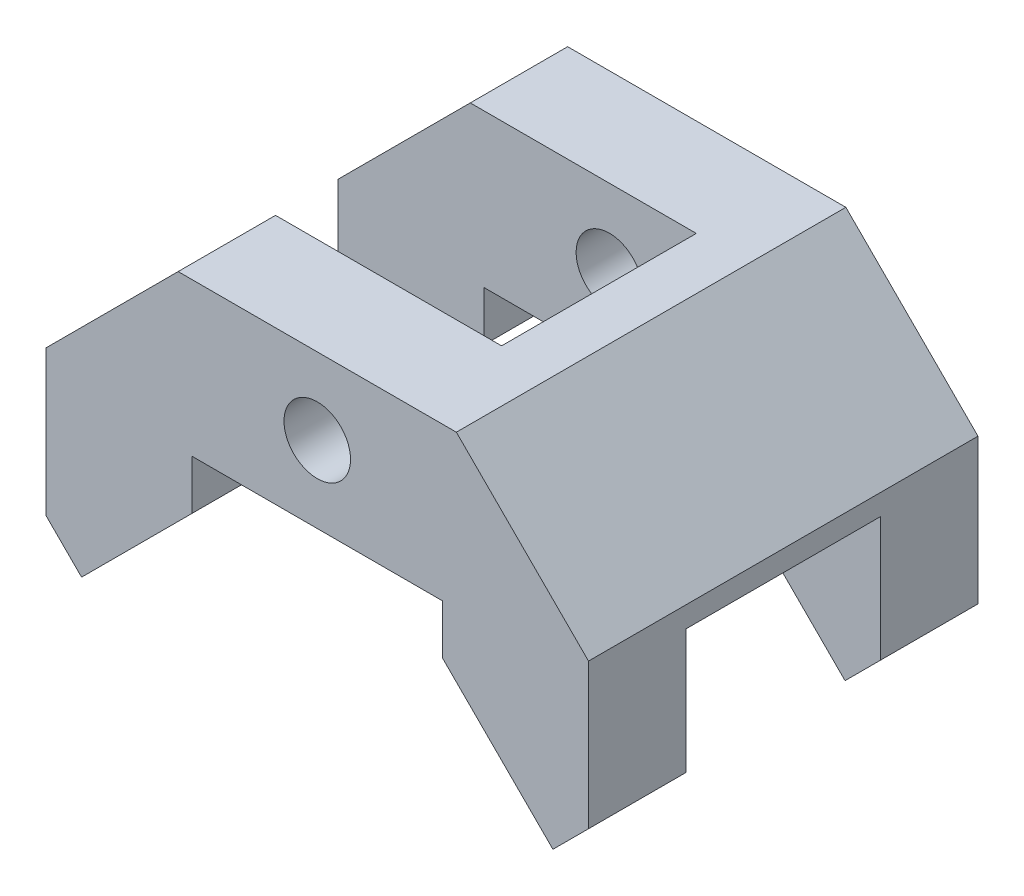
ISO-10303-21;
HEADER;
FILE_DESCRIPTION(('STEP AP214'),'2;1');
FILE_NAME('part.step','',(''),(''),'','','');
FILE_SCHEMA(('AUTOMOTIVE_DESIGN { 1 0 10303 214 1 1 1 1 }'));
ENDSEC;
DATA;
#1=APPLICATION_CONTEXT('core data for automotive mechanical design processes');
#2=APPLICATION_PROTOCOL_DEFINITION('international standard','automotive_design',2000,#1);
#3=PRODUCT_CONTEXT('',#1,'mechanical');
#4=PRODUCT('Part','Part','',(#3));
#5=PRODUCT_RELATED_PRODUCT_CATEGORY('part','',(#4));
#6=PRODUCT_DEFINITION_FORMATION('','',#4);
#7=PRODUCT_DEFINITION_CONTEXT('part definition',#1,'design');
#8=PRODUCT_DEFINITION('design','',#6,#7);
#9=PRODUCT_DEFINITION_SHAPE('','',#8);
#10=(LENGTH_UNIT() NAMED_UNIT(*) SI_UNIT(.MILLI.,.METRE.));
#11=(NAMED_UNIT(*) PLANE_ANGLE_UNIT() SI_UNIT($,.RADIAN.));
#12=(NAMED_UNIT(*) SI_UNIT($,.STERADIAN.) SOLID_ANGLE_UNIT());
#13=UNCERTAINTY_MEASURE_WITH_UNIT(LENGTH_MEASURE(1.E-05),#10,'distance_accuracy_value','');
#14=(GEOMETRIC_REPRESENTATION_CONTEXT(3) GLOBAL_UNCERTAINTY_ASSIGNED_CONTEXT((#13)) GLOBAL_UNIT_ASSIGNED_CONTEXT((#10,
#11,#12)) REPRESENTATION_CONTEXT('',''));
#15=CARTESIAN_POINT('',(0.,0.,0.));
#16=DIRECTION('',(0.,0.,1.));
#17=DIRECTION('',(1.,0.,0.));
#18=AXIS2_PLACEMENT_3D('',#15,#16,#17);
#19=CARTESIAN_POINT('',(18.,-22.,28.));
#20=DIRECTION('',(1.,0.,0.));
#21=DIRECTION('',(0.,0.,-1.));
#22=AXIS2_PLACEMENT_3D('',#19,#20,#21);
#23=PLANE('',#22);
#24=DIRECTION('',(0.,0.,-1.));
#25=VECTOR('',#24,1.);
#26=CARTESIAN_POINT('',(18.,-29.1126983722081,28.));
#27=LINE('',#26,#25);
#28=CARTESIAN_POINT('',(18.,-29.1126983722081,-14.));
#29=VERTEX_POINT('',#28);
#30=CARTESIAN_POINT('',(18.,-29.1126983722081,-28.));
#31=VERTEX_POINT('',#30);
#32=EDGE_CURVE('E360',#29,#31,#27,.T.);
#33=ORIENTED_EDGE('',*,*,#32,.F.);
#34=DIRECTION('',(0.,1.,0.));
#35=VECTOR('',#34,1.);
#36=CARTESIAN_POINT('',(18.,-22.,-14.));
#37=LINE('',#36,#35);
#38=CARTESIAN_POINT('',(18.,-22.,-14.));
#39=VERTEX_POINT('',#38);
#40=EDGE_CURVE('E235',#29,#39,#37,.T.);
#41=ORIENTED_EDGE('',*,*,#40,.T.);
#42=DIRECTION('',(0.,0.,-1.));
#43=VECTOR('',#42,1.);
#44=CARTESIAN_POINT('',(18.,-22.,28.));
#45=LINE('',#44,#43);
#46=CARTESIAN_POINT('',(18.,-22.,-28.));
#47=VERTEX_POINT('',#46);
#48=EDGE_CURVE('E204',#39,#47,#45,.T.);
#49=ORIENTED_EDGE('',*,*,#48,.T.);
#50=DIRECTION('',(0.,-1.,0.));
#51=VECTOR('',#50,1.);
#52=CARTESIAN_POINT('',(18.,-22.,-28.));
#53=LINE('',#52,#51);
#54=EDGE_CURVE('E335',#47,#31,#53,.T.);
#55=ORIENTED_EDGE('',*,*,#54,.T.);
#56=EDGE_LOOP('',(#33,#41,#49,#55));
#57=FACE_BOUND('',#56,.T.);
#58=ADVANCED_FACE('F33',(#57),#23,.F.);
#59=CARTESIAN_POINT('',(18.,-29.1126983722081,28.));
#60=DIRECTION('',(0.707106781186548,0.707106781186547,0.));
#61=DIRECTION('',(-0.707106781186547,0.707106781186548,0.));
#62=AXIS2_PLACEMENT_3D('',#59,#60,#61);
#63=PLANE('',#62);
#64=DIRECTION('',(0.,0.,-1.));
#65=VECTOR('',#64,1.);
#66=CARTESIAN_POINT('',(33.8847763108502,-44.9974746830584,28.));
#67=LINE('',#66,#65);
#68=CARTESIAN_POINT('',(33.8847763108502,-44.9974746830584,-14.));
#69=VERTEX_POINT('',#68);
#70=CARTESIAN_POINT('',(33.8847763108502,-44.9974746830584,-28.));
#71=VERTEX_POINT('',#70);
#72=EDGE_CURVE('E356',#69,#71,#67,.T.);
#73=ORIENTED_EDGE('',*,*,#72,.F.);
#74=DIRECTION('',(-0.707106781186547,0.707106781186548,0.));
#75=VECTOR('',#74,1.);
#76=CARTESIAN_POINT('',(18.,-29.1126983722081,-14.));
#77=LINE('',#76,#75);
#78=EDGE_CURVE('E232',#69,#29,#77,.T.);
#79=ORIENTED_EDGE('',*,*,#78,.T.);
#80=ORIENTED_EDGE('',*,*,#32,.T.);
#81=DIRECTION('',(0.707106781186547,-0.707106781186548,0.));
#82=VECTOR('',#81,1.);
#83=CARTESIAN_POINT('',(18.,-29.1126983722081,-28.));
#84=LINE('',#83,#82);
#85=EDGE_CURVE('E338',#31,#71,#84,.T.);
#86=ORIENTED_EDGE('',*,*,#85,.T.);
#87=EDGE_LOOP('',(#73,#79,#80,#86));
#88=FACE_BOUND('',#87,.T.);
#89=ADVANCED_FACE('F423',(#88),#63,.F.);
#90=CARTESIAN_POINT('',(33.8847763108502,-44.9974746830584,28.));
#91=DIRECTION('',(-0.707106781186547,0.707106781186548,0.));
#92=DIRECTION('',(-0.707106781186548,-0.707106781186547,0.));
#93=AXIS2_PLACEMENT_3D('',#90,#91,#92);
#94=PLANE('',#93);
#95=DIRECTION('',(0.,0.,-1.));
#96=VECTOR('',#95,1.);
#97=CARTESIAN_POINT('',(39.,-39.8822509939086,28.));
#98=LINE('',#97,#96);
#99=CARTESIAN_POINT('',(39.,-39.8822509939086,-14.));
#100=VERTEX_POINT('',#99);
#101=CARTESIAN_POINT('',(39.,-39.8822509939086,-28.));
#102=VERTEX_POINT('',#101);
#103=EDGE_CURVE('E353',#100,#102,#98,.T.);
#104=ORIENTED_EDGE('',*,*,#103,.F.);
#105=DIRECTION('',(-0.707106781186548,-0.707106781186547,0.));
#106=VECTOR('',#105,1.);
#107=CARTESIAN_POINT('',(33.8847763108502,-44.9974746830584,-14.));
#108=LINE('',#107,#106);
#109=EDGE_CURVE('E214',#100,#69,#108,.T.);
#110=ORIENTED_EDGE('',*,*,#109,.T.);
#111=ORIENTED_EDGE('',*,*,#72,.T.);
#112=DIRECTION('',(0.707106781186548,0.707106781186547,0.));
#113=VECTOR('',#112,1.);
#114=CARTESIAN_POINT('',(33.8847763108502,-44.9974746830584,-28.));
#115=LINE('',#114,#113);
#116=EDGE_CURVE('E341',#71,#102,#115,.T.);
#117=ORIENTED_EDGE('',*,*,#116,.T.);
#118=EDGE_LOOP('',(#104,#110,#111,#117));
#119=FACE_BOUND('',#118,.T.);
#120=ADVANCED_FACE('F425',(#119),#94,.F.);
#121=CARTESIAN_POINT('',(-20.,0.,28.));
#122=DIRECTION('',(0.707106781186549,-0.707106781186546,0.));
#123=DIRECTION('',(0.707106781186546,0.707106781186549,0.));
#124=AXIS2_PLACEMENT_3D('',#121,#122,#123);
#125=PLANE('',#124);
#126=DIRECTION('',(0.,0.,-1.));
#127=VECTOR('',#126,1.);
#128=CARTESIAN_POINT('',(-39.,-19.0000000000001,28.));
#129=LINE('',#128,#127);
#130=CARTESIAN_POINT('',(-39.,-19.0000000000001,-14.));
#131=VERTEX_POINT('',#130);
#132=CARTESIAN_POINT('',(-39.,-19.0000000000001,-28.));
#133=VERTEX_POINT('',#132);
#134=EDGE_CURVE('E383',#131,#133,#129,.T.);
#135=ORIENTED_EDGE('',*,*,#134,.F.);
#136=DIRECTION('',(0.707106781186546,0.707106781186549,0.));
#137=VECTOR('',#136,1.);
#138=CARTESIAN_POINT('',(-20.,0.,-14.));
#139=LINE('',#138,#137);
#140=CARTESIAN_POINT('',(-20.,0.,-14.));
#141=VERTEX_POINT('',#140);
#142=EDGE_CURVE('E280',#131,#141,#139,.T.);
#143=ORIENTED_EDGE('',*,*,#142,.T.);
#144=DIRECTION('',(0.,0.,-1.));
#145=VECTOR('',#144,1.);
#146=CARTESIAN_POINT('',(-20.,0.,28.));
#147=LINE('',#146,#145);
#148=CARTESIAN_POINT('',(-20.,0.,-28.));
#149=VERTEX_POINT('',#148);
#150=EDGE_CURVE('E387',#141,#149,#147,.T.);
#151=ORIENTED_EDGE('',*,*,#150,.T.);
#152=DIRECTION('',(-0.707106781186546,-0.707106781186549,0.));
#153=VECTOR('',#152,1.);
#154=CARTESIAN_POINT('',(-20.,0.,-28.));
#155=LINE('',#154,#153);
#156=EDGE_CURVE('E318',#149,#133,#155,.T.);
#157=ORIENTED_EDGE('',*,*,#156,.T.);
#158=EDGE_LOOP('',(#135,#143,#151,#157));
#159=FACE_BOUND('',#158,.T.);
#160=ADVANCED_FACE('F483',(#159),#125,.F.);
#161=CARTESIAN_POINT('',(-39.,-19.0000000000001,28.));
#162=DIRECTION('',(1.,0.,0.));
#163=DIRECTION('',(0.,0.,-1.));
#164=AXIS2_PLACEMENT_3D('',#161,#162,#163);
#165=PLANE('',#164);
#166=DIRECTION('',(0.,0.,-1.));
#167=VECTOR('',#166,1.);
#168=CARTESIAN_POINT('',(-39.,-39.8822509939086,28.));
#169=LINE('',#168,#167);
#170=CARTESIAN_POINT('',(-39.,-39.8822509939086,-14.));
#171=VERTEX_POINT('',#170);
#172=CARTESIAN_POINT('',(-39.,-39.8822509939086,-28.));
#173=VERTEX_POINT('',#172);
#174=EDGE_CURVE('E379',#171,#173,#169,.T.);
#175=ORIENTED_EDGE('',*,*,#174,.F.);
#176=DIRECTION('',(0.,1.,0.));
#177=VECTOR('',#176,1.);
#178=CARTESIAN_POINT('',(-39.,-44.9974746830584,-14.));
#179=LINE('',#178,#177);
#180=EDGE_CURVE('E245',#171,#131,#179,.T.);
#181=ORIENTED_EDGE('',*,*,#180,.T.);
#182=ORIENTED_EDGE('',*,*,#134,.T.);
#183=DIRECTION('',(0.,-1.,0.));
#184=VECTOR('',#183,1.);
#185=CARTESIAN_POINT('',(-39.,-19.0000000000001,-28.));
#186=LINE('',#185,#184);
#187=EDGE_CURVE('E321',#133,#173,#186,.T.);
#188=ORIENTED_EDGE('',*,*,#187,.T.);
#189=EDGE_LOOP('',(#175,#181,#182,#188));
#190=FACE_BOUND('',#189,.T.);
#191=ADVANCED_FACE('F489',(#190),#165,.F.);
#192=CARTESIAN_POINT('',(-39.,-39.8822509939086,28.));
#193=DIRECTION('',(0.707106781186546,0.707106781186549,0.));
#194=DIRECTION('',(-0.707106781186549,0.707106781186546,0.));
#195=AXIS2_PLACEMENT_3D('',#192,#193,#194);
#196=PLANE('',#195);
#197=DIRECTION('',(0.,0.,-1.));
#198=VECTOR('',#197,1.);
#199=CARTESIAN_POINT('',(-33.8847763108502,-44.9974746830584,28.));
#200=LINE('',#199,#198);
#201=CARTESIAN_POINT('',(-33.8847763108502,-44.9974746830584,-14.));
#202=VERTEX_POINT('',#201);
#203=CARTESIAN_POINT('',(-33.8847763108502,-44.9974746830584,-28.));
#204=VERTEX_POINT('',#203);
#205=EDGE_CURVE('E375',#202,#204,#200,.T.);
#206=ORIENTED_EDGE('',*,*,#205,.F.);
#207=DIRECTION('',(-0.707106781186549,0.707106781186546,0.));
#208=VECTOR('',#207,1.);
#209=CARTESIAN_POINT('',(-39.,-39.8822509939086,-14.));
#210=LINE('',#209,#208);
#211=EDGE_CURVE('E277',#202,#171,#210,.T.);
#212=ORIENTED_EDGE('',*,*,#211,.T.);
#213=ORIENTED_EDGE('',*,*,#174,.T.);
#214=DIRECTION('',(0.707106781186549,-0.707106781186546,0.));
#215=VECTOR('',#214,1.);
#216=CARTESIAN_POINT('',(-39.,-39.8822509939086,-28.));
#217=LINE('',#216,#215);
#218=EDGE_CURVE('E324',#173,#204,#217,.T.);
#219=ORIENTED_EDGE('',*,*,#218,.T.);
#220=EDGE_LOOP('',(#206,#212,#213,#219));
#221=FACE_BOUND('',#220,.T.);
#222=ADVANCED_FACE('F512',(#221),#196,.F.);
#223=CARTESIAN_POINT('',(-33.8847763108502,-44.9974746830584,28.));
#224=DIRECTION('',(-0.707106781186549,0.707106781186546,0.));
#225=DIRECTION('',(-0.707106781186546,-0.707106781186549,0.));
#226=AXIS2_PLACEMENT_3D('',#223,#224,#225);
#227=PLANE('',#226);
#228=DIRECTION('',(0.,0.,-1.));
#229=VECTOR('',#228,1.);
#230=CARTESIAN_POINT('',(-18.,-29.1126983722081,28.));
#231=LINE('',#230,#229);
#232=CARTESIAN_POINT('',(-18.,-29.1126983722081,-14.));
#233=VERTEX_POINT('',#232);
#234=CARTESIAN_POINT('',(-18.,-29.1126983722081,-28.));
#235=VERTEX_POINT('',#234);
#236=EDGE_CURVE('E371',#233,#235,#231,.T.);
#237=ORIENTED_EDGE('',*,*,#236,.F.);
#238=DIRECTION('',(-0.707106781186546,-0.707106781186549,0.));
#239=VECTOR('',#238,1.);
#240=CARTESIAN_POINT('',(-33.8847763108502,-44.9974746830584,-14.));
#241=LINE('',#240,#239);
#242=EDGE_CURVE('E274',#233,#202,#241,.T.);
#243=ORIENTED_EDGE('',*,*,#242,.T.);
#244=ORIENTED_EDGE('',*,*,#205,.T.);
#245=DIRECTION('',(0.707106781186546,0.707106781186549,0.));
#246=VECTOR('',#245,1.);
#247=CARTESIAN_POINT('',(-33.8847763108502,-44.9974746830584,-28.));
#248=LINE('',#247,#246);
#249=EDGE_CURVE('E327',#204,#235,#248,.T.);
#250=ORIENTED_EDGE('',*,*,#249,.T.);
#251=EDGE_LOOP('',(#237,#243,#244,#250));
#252=FACE_BOUND('',#251,.T.);
#253=ADVANCED_FACE('F407',(#252),#227,.F.);
#254=CARTESIAN_POINT('',(-18.,-29.1126983722081,28.));
#255=DIRECTION('',(-1.,0.,0.));
#256=DIRECTION('',(0.,-1.,0.));
#257=AXIS2_PLACEMENT_3D('',#254,#255,#256);
#258=PLANE('',#257);
#259=DIRECTION('',(0.,0.,-1.));
#260=VECTOR('',#259,1.);
#261=CARTESIAN_POINT('',(-18.,-22.,28.));
#262=LINE('',#261,#260);
#263=CARTESIAN_POINT('',(-18.,-22.,-14.));
#264=VERTEX_POINT('',#263);
#265=CARTESIAN_POINT('',(-18.,-22.,-28.));
#266=VERTEX_POINT('',#265);
#267=EDGE_CURVE('E367',#264,#266,#262,.T.);
#268=ORIENTED_EDGE('',*,*,#267,.F.);
#269=DIRECTION('',(0.,-1.,0.));
#270=VECTOR('',#269,1.);
#271=CARTESIAN_POINT('',(-18.,-29.1126983722081,-14.));
#272=LINE('',#271,#270);
#273=EDGE_CURVE('E271',#264,#233,#272,.T.);
#274=ORIENTED_EDGE('',*,*,#273,.T.);
#275=ORIENTED_EDGE('',*,*,#236,.T.);
#276=DIRECTION('',(0.,1.,0.));
#277=VECTOR('',#276,1.);
#278=CARTESIAN_POINT('',(-18.,-29.1126983722081,-28.));
#279=LINE('',#278,#277);
#280=EDGE_CURVE('E330',#235,#266,#279,.T.);
#281=ORIENTED_EDGE('',*,*,#280,.T.);
#282=EDGE_LOOP('',(#268,#274,#275,#281));
#283=FACE_BOUND('',#282,.T.);
#284=ADVANCED_FACE('F405',(#283),#258,.F.);
#285=CARTESIAN_POINT('',(0.,-11.,28.));
#286=DIRECTION('',(0.,0.,-1.));
#287=DIRECTION('',(-1.,0.,0.));
#288=AXIS2_PLACEMENT_3D('',#285,#286,#287);
#289=CYLINDRICAL_SURFACE('',#288,4.78154306918594);
#290=CARTESIAN_POINT('',(0.,-11.,-14.));
#291=DIRECTION('',(0.,0.,-1.));
#292=DIRECTION('',(-1.,0.,0.));
#293=AXIS2_PLACEMENT_3D('',#290,#291,#292);
#294=CIRCLE('',#293,4.78154306918594);
#295=CARTESIAN_POINT('',(-4.78154306918593,-11.,-14.));
#296=VERTEX_POINT('',#295);
#297=EDGE_CURVE('E267',#296,#296,#294,.T.);
#298=ORIENTED_EDGE('',*,*,#297,.F.);
#299=EDGE_LOOP('',(#298));
#300=FACE_BOUND('',#299,.T.);
#301=CARTESIAN_POINT('',(0.,-11.,-28.));
#302=DIRECTION('',(0.,0.,1.));
#303=DIRECTION('',(1.,0.,0.));
#304=AXIS2_PLACEMENT_3D('',#301,#302,#303);
#305=CIRCLE('',#304,4.78154306918594);
#306=CARTESIAN_POINT('',(4.78154306918594,-11.,-28.));
#307=VERTEX_POINT('',#306);
#308=EDGE_CURVE('E283',#307,#307,#305,.T.);
#309=ORIENTED_EDGE('',*,*,#308,.F.);
#310=EDGE_LOOP('',(#309));
#311=FACE_BOUND('',#310,.T.);
#312=ADVANCED_FACE('F585',(#300,#311),#289,.F.);
#313=CARTESIAN_POINT('',(0.,0.,28.));
#314=DIRECTION('',(0.,0.,1.));
#315=DIRECTION('',(1.,0.,0.));
#316=AXIS2_PLACEMENT_3D('',#313,#314,#315);
#317=PLANE('',#316);
#318=DIRECTION('',(-1.,0.,0.));
#319=VECTOR('',#318,1.);
#320=CARTESIAN_POINT('',(20.,0.,28.));
#321=LINE('',#320,#319);
#322=CARTESIAN_POINT('',(20.,0.,28.));
#323=VERTEX_POINT('',#322);
#324=CARTESIAN_POINT('',(-20.,0.,28.));
#325=VERTEX_POINT('',#324);
#326=EDGE_CURVE('E290',#323,#325,#321,.T.);
#327=ORIENTED_EDGE('',*,*,#326,.T.);
#328=DIRECTION('',(-0.707106781186546,-0.707106781186549,0.));
#329=VECTOR('',#328,1.);
#330=CARTESIAN_POINT('',(-20.,0.,28.));
#331=LINE('',#330,#329);
#332=CARTESIAN_POINT('',(-39.,-19.0000000000001,28.));
#333=VERTEX_POINT('',#332);
#334=EDGE_CURVE('E292',#325,#333,#331,.T.);
#335=ORIENTED_EDGE('',*,*,#334,.T.);
#336=DIRECTION('',(0.,-1.,0.));
#337=VECTOR('',#336,1.);
#338=CARTESIAN_POINT('',(-39.,-19.0000000000001,28.));
#339=LINE('',#338,#337);
#340=CARTESIAN_POINT('',(-39.,-39.8822509939086,28.));
#341=VERTEX_POINT('',#340);
#342=EDGE_CURVE('E295',#333,#341,#339,.T.);
#343=ORIENTED_EDGE('',*,*,#342,.T.);
#344=DIRECTION('',(0.707106781186549,-0.707106781186546,0.));
#345=VECTOR('',#344,1.);
#346=CARTESIAN_POINT('',(-39.,-39.8822509939086,28.));
#347=LINE('',#346,#345);
#348=CARTESIAN_POINT('',(-33.8847763108502,-44.9974746830584,28.));
#349=VERTEX_POINT('',#348);
#350=EDGE_CURVE('E297',#341,#349,#347,.T.);
#351=ORIENTED_EDGE('',*,*,#350,.T.);
#352=DIRECTION('',(0.707106781186546,0.707106781186549,0.));
#353=VECTOR('',#352,1.);
#354=CARTESIAN_POINT('',(-33.8847763108502,-44.9974746830584,28.));
#355=LINE('',#354,#353);
#356=CARTESIAN_POINT('',(-18.,-29.1126983722081,28.));
#357=VERTEX_POINT('',#356);
#358=EDGE_CURVE('E299',#349,#357,#355,.T.);
#359=ORIENTED_EDGE('',*,*,#358,.T.);
#360=DIRECTION('',(0.,1.,0.));
#361=VECTOR('',#360,1.);
#362=CARTESIAN_POINT('',(-18.,-29.1126983722081,28.));
#363=LINE('',#362,#361);
#364=CARTESIAN_POINT('',(-18.,-22.,28.));
#365=VERTEX_POINT('',#364);
#366=EDGE_CURVE('E301',#357,#365,#363,.T.);
#367=ORIENTED_EDGE('',*,*,#366,.T.);
#368=DIRECTION('',(1.,0.,0.));
#369=VECTOR('',#368,1.);
#370=CARTESIAN_POINT('',(-18.,-22.,28.));
#371=LINE('',#370,#369);
#372=CARTESIAN_POINT('',(18.,-22.,28.));
#373=VERTEX_POINT('',#372);
#374=EDGE_CURVE('E303',#365,#373,#371,.T.);
#375=ORIENTED_EDGE('',*,*,#374,.T.);
#376=DIRECTION('',(0.,-1.,0.));
#377=VECTOR('',#376,1.);
#378=CARTESIAN_POINT('',(18.,-22.,28.));
#379=LINE('',#378,#377);
#380=CARTESIAN_POINT('',(18.,-29.1126983722081,28.));
#381=VERTEX_POINT('',#380);
#382=EDGE_CURVE('E305',#373,#381,#379,.T.);
#383=ORIENTED_EDGE('',*,*,#382,.T.);
#384=DIRECTION('',(0.707106781186547,-0.707106781186548,0.));
#385=VECTOR('',#384,1.);
#386=CARTESIAN_POINT('',(18.,-29.1126983722081,28.));
#387=LINE('',#386,#385);
#388=CARTESIAN_POINT('',(33.8847763108502,-44.9974746830584,28.));
#389=VERTEX_POINT('',#388);
#390=EDGE_CURVE('E307',#381,#389,#387,.T.);
#391=ORIENTED_EDGE('',*,*,#390,.T.);
#392=DIRECTION('',(0.707106781186548,0.707106781186547,0.));
#393=VECTOR('',#392,1.);
#394=CARTESIAN_POINT('',(33.8847763108502,-44.9974746830584,28.));
#395=LINE('',#394,#393);
#396=CARTESIAN_POINT('',(39.,-39.8822509939086,28.));
#397=VERTEX_POINT('',#396);
#398=EDGE_CURVE('E309',#389,#397,#395,.T.);
#399=ORIENTED_EDGE('',*,*,#398,.T.);
#400=DIRECTION('',(0.,1.,0.));
#401=VECTOR('',#400,1.);
#402=CARTESIAN_POINT('',(39.,-39.8822509939086,28.));
#403=LINE('',#402,#401);
#404=CARTESIAN_POINT('',(39.,-19.0000000000001,28.));
#405=VERTEX_POINT('',#404);
#406=EDGE_CURVE('E311',#397,#405,#403,.T.);
#407=ORIENTED_EDGE('',*,*,#406,.T.);
#408=DIRECTION('',(-0.707106781186547,0.707106781186548,0.));
#409=VECTOR('',#408,1.);
#410=CARTESIAN_POINT('',(39.,-19.0000000000001,28.));
#411=LINE('',#410,#409);
#412=EDGE_CURVE('E313',#405,#323,#411,.T.);
#413=ORIENTED_EDGE('',*,*,#412,.T.);
#414=EDGE_LOOP('',(#327,#335,#343,#351,#359,#367,#375,#383,#391,#399,#407,#413));
#415=FACE_BOUND('',#414,.T.);
#416=CARTESIAN_POINT('',(0.,-11.,28.));
#417=DIRECTION('',(0.,0.,1.));
#418=DIRECTION('',(1.,0.,0.));
#419=AXIS2_PLACEMENT_3D('',#416,#417,#418);
#420=CIRCLE('',#419,4.78154306918594);
#421=CARTESIAN_POINT('',(4.78154306918594,-11.,28.));
#422=VERTEX_POINT('',#421);
#423=EDGE_CURVE('E284',#422,#422,#420,.T.);
#424=ORIENTED_EDGE('',*,*,#423,.F.);
#425=EDGE_LOOP('',(#424));
#426=FACE_BOUND('',#425,.T.);
#427=ADVANCED_FACE('F443',(#415,#426),#317,.T.);
#428=CARTESIAN_POINT('',(0.,0.,-28.));
#429=DIRECTION('',(0.,0.,1.));
#430=DIRECTION('',(1.,0.,0.));
#431=AXIS2_PLACEMENT_3D('',#428,#429,#430);
#432=PLANE('',#431);
#433=DIRECTION('',(-1.,0.,0.));
#434=VECTOR('',#433,1.);
#435=CARTESIAN_POINT('',(0.,0.,-28.));
#436=LINE('',#435,#434);
#437=CARTESIAN_POINT('',(20.,0.,-28.));
#438=VERTEX_POINT('',#437);
#439=EDGE_CURVE('E287',#438,#149,#436,.T.);
#440=ORIENTED_EDGE('',*,*,#439,.F.);
#441=DIRECTION('',(-0.707106781186547,0.707106781186548,0.));
#442=VECTOR('',#441,1.);
#443=CARTESIAN_POINT('',(39.,-19.0000000000001,-28.));
#444=LINE('',#443,#442);
#445=CARTESIAN_POINT('',(39.,-19.0000000000001,-28.));
#446=VERTEX_POINT('',#445);
#447=EDGE_CURVE('E293',#446,#438,#444,.T.);
#448=ORIENTED_EDGE('',*,*,#447,.F.);
#449=DIRECTION('',(0.,1.,0.));
#450=VECTOR('',#449,1.);
#451=CARTESIAN_POINT('',(39.,-39.8822509939086,-28.));
#452=LINE('',#451,#450);
#453=EDGE_CURVE('E344',#102,#446,#452,.T.);
#454=ORIENTED_EDGE('',*,*,#453,.F.);
#455=ORIENTED_EDGE('',*,*,#116,.F.);
#456=ORIENTED_EDGE('',*,*,#85,.F.);
#457=ORIENTED_EDGE('',*,*,#54,.F.);
#458=DIRECTION('',(1.,0.,0.));
#459=VECTOR('',#458,1.);
#460=CARTESIAN_POINT('',(-18.,-22.,-28.));
#461=LINE('',#460,#459);
#462=EDGE_CURVE('E333',#266,#47,#461,.T.);
#463=ORIENTED_EDGE('',*,*,#462,.F.);
#464=ORIENTED_EDGE('',*,*,#280,.F.);
#465=ORIENTED_EDGE('',*,*,#249,.F.);
#466=ORIENTED_EDGE('',*,*,#218,.F.);
#467=ORIENTED_EDGE('',*,*,#187,.F.);
#468=ORIENTED_EDGE('',*,*,#156,.F.);
#469=EDGE_LOOP('',(#440,#448,#454,#455,#456,#457,#463,#464,#465,#466,#467,#468));
#470=FACE_BOUND('',#469,.T.);
#471=ORIENTED_EDGE('',*,*,#308,.T.);
#472=EDGE_LOOP('',(#471));
#473=FACE_BOUND('',#472,.T.);
#474=ADVANCED_FACE('F414',(#470,#473),#432,.F.);
#475=CARTESIAN_POINT('',(0.,0.,28.));
#476=DIRECTION('',(0.,-1.,0.));
#477=DIRECTION('',(1.,0.,0.));
#478=AXIS2_PLACEMENT_3D('',#475,#476,#477);
#479=PLANE('',#478);
#480=ORIENTED_EDGE('',*,*,#150,.F.);
#481=DIRECTION('',(-1.,0.,0.));
#482=VECTOR('',#481,1.);
#483=CARTESIAN_POINT('',(-39.,0.,-14.));
#484=LINE('',#483,#482);
#485=CARTESIAN_POINT('',(12.5,0.,-14.));
#486=VERTEX_POINT('',#485);
#487=EDGE_CURVE('E242',#486,#141,#484,.T.);
#488=ORIENTED_EDGE('',*,*,#487,.F.);
#489=DIRECTION('',(0.,0.,-1.));
#490=VECTOR('',#489,1.);
#491=CARTESIAN_POINT('',(12.5,0.,-14.));
#492=LINE('',#491,#490);
#493=CARTESIAN_POINT('',(12.5,0.,14.));
#494=VERTEX_POINT('',#493);
#495=EDGE_CURVE('E239',#494,#486,#492,.T.);
#496=ORIENTED_EDGE('',*,*,#495,.F.);
#497=DIRECTION('',(1.,0.,0.));
#498=VECTOR('',#497,1.);
#499=CARTESIAN_POINT('',(-39.,0.,14.));
#500=LINE('',#499,#498);
#501=CARTESIAN_POINT('',(-20.,0.,14.));
#502=VERTEX_POINT('',#501);
#503=EDGE_CURVE('E237',#502,#494,#500,.T.);
#504=ORIENTED_EDGE('',*,*,#503,.F.);
#505=EDGE_CURVE('E388',#325,#502,#147,.T.);
#506=ORIENTED_EDGE('',*,*,#505,.F.);
#507=ORIENTED_EDGE('',*,*,#326,.F.);
#508=DIRECTION('',(0.,0.,-1.));
#509=VECTOR('',#508,1.);
#510=CARTESIAN_POINT('',(20.,0.,28.));
#511=LINE('',#510,#509);
#512=EDGE_CURVE('E315',#323,#438,#511,.T.);
#513=ORIENTED_EDGE('',*,*,#512,.T.);
#514=ORIENTED_EDGE('',*,*,#439,.T.);
#515=EDGE_LOOP('',(#480,#488,#496,#504,#506,#507,#513,#514));
#516=FACE_BOUND('',#515,.T.);
#517=ADVANCED_FACE('F35',(#516),#479,.F.);
#518=ORIENTED_EDGE('',*,*,#505,.T.);
#519=DIRECTION('',(-0.707106781186546,-0.707106781186549,0.));
#520=VECTOR('',#519,1.);
#521=CARTESIAN_POINT('',(-20.,0.,14.));
#522=LINE('',#521,#520);
#523=CARTESIAN_POINT('',(-39.,-19.0000000000001,14.));
#524=VERTEX_POINT('',#523);
#525=EDGE_CURVE('E264',#502,#524,#522,.T.);
#526=ORIENTED_EDGE('',*,*,#525,.T.);
#527=EDGE_CURVE('E384',#333,#524,#129,.T.);
#528=ORIENTED_EDGE('',*,*,#527,.F.);
#529=ORIENTED_EDGE('',*,*,#334,.F.);
#530=EDGE_LOOP('',(#518,#526,#528,#529));
#531=FACE_BOUND('',#530,.T.);
#532=ADVANCED_FACE('F481',(#531),#125,.F.);
#533=ORIENTED_EDGE('',*,*,#527,.T.);
#534=DIRECTION('',(0.,1.,0.));
#535=VECTOR('',#534,1.);
#536=CARTESIAN_POINT('',(-39.,-44.9974746830584,14.));
#537=LINE('',#536,#535);
#538=CARTESIAN_POINT('',(-39.,-39.8822509939086,14.));
#539=VERTEX_POINT('',#538);
#540=EDGE_CURVE('E244',#539,#524,#537,.T.);
#541=ORIENTED_EDGE('',*,*,#540,.F.);
#542=EDGE_CURVE('E380',#341,#539,#169,.T.);
#543=ORIENTED_EDGE('',*,*,#542,.F.);
#544=ORIENTED_EDGE('',*,*,#342,.F.);
#545=EDGE_LOOP('',(#533,#541,#543,#544));
#546=FACE_BOUND('',#545,.T.);
#547=ADVANCED_FACE('F478',(#546),#165,.F.);
#548=ORIENTED_EDGE('',*,*,#542,.T.);
#549=DIRECTION('',(0.707106781186549,-0.707106781186546,0.));
#550=VECTOR('',#549,1.);
#551=CARTESIAN_POINT('',(-39.,-39.8822509939086,14.));
#552=LINE('',#551,#550);
#553=CARTESIAN_POINT('',(-33.8847763108502,-44.9974746830584,14.));
#554=VERTEX_POINT('',#553);
#555=EDGE_CURVE('E261',#539,#554,#552,.T.);
#556=ORIENTED_EDGE('',*,*,#555,.T.);
#557=EDGE_CURVE('E376',#349,#554,#200,.T.);
#558=ORIENTED_EDGE('',*,*,#557,.F.);
#559=ORIENTED_EDGE('',*,*,#350,.F.);
#560=EDGE_LOOP('',(#548,#556,#558,#559));
#561=FACE_BOUND('',#560,.T.);
#562=ADVANCED_FACE('F474',(#561),#196,.F.);
#563=ORIENTED_EDGE('',*,*,#557,.T.);
#564=DIRECTION('',(0.707106781186546,0.707106781186549,0.));
#565=VECTOR('',#564,1.);
#566=CARTESIAN_POINT('',(-33.8847763108502,-44.9974746830584,14.));
#567=LINE('',#566,#565);
#568=CARTESIAN_POINT('',(-18.,-29.1126983722081,14.));
#569=VERTEX_POINT('',#568);
#570=EDGE_CURVE('E258',#554,#569,#567,.T.);
#571=ORIENTED_EDGE('',*,*,#570,.T.);
#572=EDGE_CURVE('E372',#357,#569,#231,.T.);
#573=ORIENTED_EDGE('',*,*,#572,.F.);
#574=ORIENTED_EDGE('',*,*,#358,.F.);
#575=EDGE_LOOP('',(#563,#571,#573,#574));
#576=FACE_BOUND('',#575,.T.);
#577=ADVANCED_FACE('F470',(#576),#227,.F.);
#578=ORIENTED_EDGE('',*,*,#572,.T.);
#579=DIRECTION('',(0.,1.,0.));
#580=VECTOR('',#579,1.);
#581=CARTESIAN_POINT('',(-18.,-29.1126983722081,14.));
#582=LINE('',#581,#580);
#583=CARTESIAN_POINT('',(-18.,-22.,14.));
#584=VERTEX_POINT('',#583);
#585=EDGE_CURVE('E255',#569,#584,#582,.T.);
#586=ORIENTED_EDGE('',*,*,#585,.T.);
#587=EDGE_CURVE('E368',#365,#584,#262,.T.);
#588=ORIENTED_EDGE('',*,*,#587,.F.);
#589=ORIENTED_EDGE('',*,*,#366,.F.);
#590=EDGE_LOOP('',(#578,#586,#588,#589));
#591=FACE_BOUND('',#590,.T.);
#592=ADVANCED_FACE('F467',(#591),#258,.F.);
#593=CARTESIAN_POINT('',(-18.,-22.,28.));
#594=DIRECTION('',(0.,1.,0.));
#595=DIRECTION('',(0.,0.,1.));
#596=AXIS2_PLACEMENT_3D('',#593,#594,#595);
#597=PLANE('',#596);
#598=DIRECTION('',(1.,0.,0.));
#599=VECTOR('',#598,1.);
#600=CARTESIAN_POINT('',(-18.,-22.,14.));
#601=LINE('',#600,#599);
#602=CARTESIAN_POINT('',(12.5,-22.,14.));
#603=VERTEX_POINT('',#602);
#604=EDGE_CURVE('E253',#584,#603,#601,.T.);
#605=ORIENTED_EDGE('',*,*,#604,.T.);
#606=DIRECTION('',(0.,0.,-1.));
#607=VECTOR('',#606,1.);
#608=CARTESIAN_POINT('',(12.5,-22.,28.));
#609=LINE('',#608,#607);
#610=CARTESIAN_POINT('',(12.5,-22.,-14.));
#611=VERTEX_POINT('',#610);
#612=EDGE_CURVE('E41',#603,#611,#609,.T.);
#613=ORIENTED_EDGE('',*,*,#612,.T.);
#614=DIRECTION('',(-1.,0.,0.));
#615=VECTOR('',#614,1.);
#616=CARTESIAN_POINT('',(-18.,-22.,-14.));
#617=LINE('',#616,#615);
#618=EDGE_CURVE('E268',#611,#264,#617,.T.);
#619=ORIENTED_EDGE('',*,*,#618,.T.);
#620=ORIENTED_EDGE('',*,*,#267,.T.);
#621=ORIENTED_EDGE('',*,*,#462,.T.);
#622=ORIENTED_EDGE('',*,*,#48,.F.);
#623=DIRECTION('',(-1.,0.,0.));
#624=VECTOR('',#623,1.);
#625=CARTESIAN_POINT('',(39.,-22.,-14.));
#626=LINE('',#625,#624);
#627=CARTESIAN_POINT('',(39.,-22.,-14.));
#628=VERTEX_POINT('',#627);
#629=EDGE_CURVE('E199',#628,#39,#626,.T.);
#630=ORIENTED_EDGE('',*,*,#629,.F.);
#631=DIRECTION('',(0.,0.,-1.));
#632=VECTOR('',#631,1.);
#633=CARTESIAN_POINT('',(39.,-22.,-14.));
#634=LINE('',#633,#632);
#635=CARTESIAN_POINT('',(39.,-22.,14.));
#636=VERTEX_POINT('',#635);
#637=EDGE_CURVE('E48',#636,#628,#634,.T.);
#638=ORIENTED_EDGE('',*,*,#637,.F.);
#639=DIRECTION('',(-1.,0.,0.));
#640=VECTOR('',#639,1.);
#641=CARTESIAN_POINT('',(39.,-22.,14.));
#642=LINE('',#641,#640);
#643=CARTESIAN_POINT('',(18.,-22.,14.));
#644=VERTEX_POINT('',#643);
#645=EDGE_CURVE('E208',#636,#644,#642,.T.);
#646=ORIENTED_EDGE('',*,*,#645,.T.);
#647=EDGE_CURVE('E364',#373,#644,#45,.T.);
#648=ORIENTED_EDGE('',*,*,#647,.F.);
#649=ORIENTED_EDGE('',*,*,#374,.F.);
#650=ORIENTED_EDGE('',*,*,#587,.T.);
#651=EDGE_LOOP('',(#605,#613,#619,#620,#621,#622,#630,#638,#646,#648,#649,#650));
#652=FACE_BOUND('',#651,.T.);
#653=ADVANCED_FACE('F202',(#652),#597,.F.);
#654=ORIENTED_EDGE('',*,*,#647,.T.);
#655=DIRECTION('',(0.,-1.,0.));
#656=VECTOR('',#655,1.);
#657=CARTESIAN_POINT('',(18.,-22.,14.));
#658=LINE('',#657,#656);
#659=CARTESIAN_POINT('',(18.,-29.1126983722081,14.));
#660=VERTEX_POINT('',#659);
#661=EDGE_CURVE('E228',#644,#660,#658,.T.);
#662=ORIENTED_EDGE('',*,*,#661,.T.);
#663=EDGE_CURVE('E361',#381,#660,#27,.T.);
#664=ORIENTED_EDGE('',*,*,#663,.F.);
#665=ORIENTED_EDGE('',*,*,#382,.F.);
#666=EDGE_LOOP('',(#654,#662,#664,#665));
#667=FACE_BOUND('',#666,.T.);
#668=ADVANCED_FACE('F459',(#667),#23,.F.);
#669=ORIENTED_EDGE('',*,*,#663,.T.);
#670=DIRECTION('',(0.707106781186547,-0.707106781186548,0.));
#671=VECTOR('',#670,1.);
#672=CARTESIAN_POINT('',(18.,-29.1126983722081,14.));
#673=LINE('',#672,#671);
#674=CARTESIAN_POINT('',(33.8847763108502,-44.9974746830584,14.));
#675=VERTEX_POINT('',#674);
#676=EDGE_CURVE('E225',#660,#675,#673,.T.);
#677=ORIENTED_EDGE('',*,*,#676,.T.);
#678=EDGE_CURVE('E357',#389,#675,#67,.T.);
#679=ORIENTED_EDGE('',*,*,#678,.F.);
#680=ORIENTED_EDGE('',*,*,#390,.F.);
#681=EDGE_LOOP('',(#669,#677,#679,#680));
#682=FACE_BOUND('',#681,.T.);
#683=ADVANCED_FACE('F454',(#682),#63,.F.);
#684=ORIENTED_EDGE('',*,*,#678,.T.);
#685=DIRECTION('',(0.707106781186548,0.707106781186547,0.));
#686=VECTOR('',#685,1.);
#687=CARTESIAN_POINT('',(33.8847763108502,-44.9974746830584,14.));
#688=LINE('',#687,#686);
#689=CARTESIAN_POINT('',(39.,-39.8822509939086,14.));
#690=VERTEX_POINT('',#689);
#691=EDGE_CURVE('E207',#675,#690,#688,.T.);
#692=ORIENTED_EDGE('',*,*,#691,.T.);
#693=EDGE_CURVE('E354',#397,#690,#98,.T.);
#694=ORIENTED_EDGE('',*,*,#693,.F.);
#695=ORIENTED_EDGE('',*,*,#398,.F.);
#696=EDGE_LOOP('',(#684,#692,#694,#695));
#697=FACE_BOUND('',#696,.T.);
#698=ADVANCED_FACE('F449',(#697),#94,.F.);
#699=CARTESIAN_POINT('',(39.,-39.8822509939086,28.));
#700=DIRECTION('',(-1.,0.,0.));
#701=DIRECTION('',(0.,-1.,0.));
#702=AXIS2_PLACEMENT_3D('',#699,#700,#701);
#703=PLANE('',#702);
#704=ORIENTED_EDGE('',*,*,#637,.T.);
#705=DIRECTION('',(0.,-1.,0.));
#706=VECTOR('',#705,1.);
#707=CARTESIAN_POINT('',(39.,-45.2358172252474,-14.));
#708=LINE('',#707,#706);
#709=EDGE_CURVE('E211',#628,#100,#708,.T.);
#710=ORIENTED_EDGE('',*,*,#709,.T.);
#711=ORIENTED_EDGE('',*,*,#103,.T.);
#712=ORIENTED_EDGE('',*,*,#453,.T.);
#713=DIRECTION('',(0.,0.,-1.));
#714=VECTOR('',#713,1.);
#715=CARTESIAN_POINT('',(39.,-19.0000000000001,28.));
#716=LINE('',#715,#714);
#717=EDGE_CURVE('E350',#405,#446,#716,.T.);
#718=ORIENTED_EDGE('',*,*,#717,.F.);
#719=ORIENTED_EDGE('',*,*,#406,.F.);
#720=ORIENTED_EDGE('',*,*,#693,.T.);
#721=DIRECTION('',(0.,1.,0.));
#722=VECTOR('',#721,1.);
#723=CARTESIAN_POINT('',(39.,-39.8822509939086,14.));
#724=LINE('',#723,#722);
#725=EDGE_CURVE('E11',#690,#636,#724,.T.);
#726=ORIENTED_EDGE('',*,*,#725,.T.);
#727=EDGE_LOOP('',(#704,#710,#711,#712,#718,#719,#720,#726));
#728=FACE_BOUND('',#727,.T.);
#729=ADVANCED_FACE('F218',(#728),#703,.F.);
#730=CARTESIAN_POINT('',(39.,-19.0000000000001,28.));
#731=DIRECTION('',(-0.707106781186548,-0.707106781186547,0.));
#732=DIRECTION('',(0.707106781186547,-0.707106781186548,0.));
#733=AXIS2_PLACEMENT_3D('',#730,#731,#732);
#734=PLANE('',#733);
#735=ORIENTED_EDGE('',*,*,#447,.T.);
#736=ORIENTED_EDGE('',*,*,#512,.F.);
#737=ORIENTED_EDGE('',*,*,#412,.F.);
#738=ORIENTED_EDGE('',*,*,#717,.T.);
#739=EDGE_LOOP('',(#735,#736,#737,#738));
#740=FACE_BOUND('',#739,.T.);
#741=ADVANCED_FACE('F432',(#740),#734,.F.);
#742=CARTESIAN_POINT('',(0.,-11.,14.));
#743=DIRECTION('',(0.,0.,1.));
#744=DIRECTION('',(1.,0.,0.));
#745=AXIS2_PLACEMENT_3D('',#742,#743,#744);
#746=CIRCLE('',#745,4.78154306918594);
#747=CARTESIAN_POINT('',(4.78154306918594,-11.,14.));
#748=VERTEX_POINT('',#747);
#749=EDGE_CURVE('E248',#748,#748,#746,.T.);
#750=ORIENTED_EDGE('',*,*,#749,.F.);
#751=EDGE_LOOP('',(#750));
#752=FACE_BOUND('',#751,.T.);
#753=ORIENTED_EDGE('',*,*,#423,.T.);
#754=EDGE_LOOP('',(#753));
#755=FACE_BOUND('',#754,.T.);
#756=ADVANCED_FACE('F574',(#752,#755),#289,.F.);
#757=CARTESIAN_POINT('',(12.5,-44.9974746830584,-14.));
#758=DIRECTION('',(1.,0.,0.));
#759=DIRECTION('',(0.,0.,-1.));
#760=AXIS2_PLACEMENT_3D('',#757,#758,#759);
#761=PLANE('',#760);
#762=DIRECTION('',(0.,1.,0.));
#763=VECTOR('',#762,1.);
#764=CARTESIAN_POINT('',(12.5,-44.9974746830584,14.));
#765=LINE('',#764,#763);
#766=EDGE_CURVE('E56',#603,#494,#765,.T.);
#767=ORIENTED_EDGE('',*,*,#766,.T.);
#768=ORIENTED_EDGE('',*,*,#495,.T.);
#769=DIRECTION('',(0.,1.,0.));
#770=VECTOR('',#769,1.);
#771=CARTESIAN_POINT('',(12.5,-44.9974746830584,-14.));
#772=LINE('',#771,#770);
#773=EDGE_CURVE('E249',#611,#486,#772,.T.);
#774=ORIENTED_EDGE('',*,*,#773,.F.);
#775=ORIENTED_EDGE('',*,*,#612,.F.);
#776=EDGE_LOOP('',(#767,#768,#774,#775));
#777=FACE_BOUND('',#776,.T.);
#778=ADVANCED_FACE('F398',(#777),#761,.F.);
#779=CARTESIAN_POINT('',(-39.,-44.9974746830584,-14.));
#780=DIRECTION('',(0.,0.,-1.));
#781=DIRECTION('',(-1.,0.,0.));
#782=AXIS2_PLACEMENT_3D('',#779,#780,#781);
#783=PLANE('',#782);
#784=ORIENTED_EDGE('',*,*,#297,.T.);
#785=EDGE_LOOP('',(#784));
#786=FACE_BOUND('',#785,.T.);
#787=ORIENTED_EDGE('',*,*,#180,.F.);
#788=ORIENTED_EDGE('',*,*,#211,.F.);
#789=ORIENTED_EDGE('',*,*,#242,.F.);
#790=ORIENTED_EDGE('',*,*,#273,.F.);
#791=ORIENTED_EDGE('',*,*,#618,.F.);
#792=ORIENTED_EDGE('',*,*,#773,.T.);
#793=ORIENTED_EDGE('',*,*,#487,.T.);
#794=ORIENTED_EDGE('',*,*,#142,.F.);
#795=EDGE_LOOP('',(#787,#788,#789,#790,#791,#792,#793,#794));
#796=FACE_BOUND('',#795,.T.);
#797=ADVANCED_FACE('F402',(#786,#796),#783,.F.);
#798=CARTESIAN_POINT('',(-39.,-44.9974746830584,14.));
#799=DIRECTION('',(0.,0.,1.));
#800=DIRECTION('',(1.,0.,0.));
#801=AXIS2_PLACEMENT_3D('',#798,#799,#800);
#802=PLANE('',#801);
#803=ORIENTED_EDGE('',*,*,#749,.T.);
#804=EDGE_LOOP('',(#803));
#805=FACE_BOUND('',#804,.T.);
#806=ORIENTED_EDGE('',*,*,#503,.T.);
#807=ORIENTED_EDGE('',*,*,#766,.F.);
#808=ORIENTED_EDGE('',*,*,#604,.F.);
#809=ORIENTED_EDGE('',*,*,#585,.F.);
#810=ORIENTED_EDGE('',*,*,#570,.F.);
#811=ORIENTED_EDGE('',*,*,#555,.F.);
#812=ORIENTED_EDGE('',*,*,#540,.T.);
#813=ORIENTED_EDGE('',*,*,#525,.F.);
#814=EDGE_LOOP('',(#806,#807,#808,#809,#810,#811,#812,#813));
#815=FACE_BOUND('',#814,.T.);
#816=ADVANCED_FACE('F468',(#805,#815),#802,.F.);
#817=CARTESIAN_POINT('',(39.,-45.2358172252474,-14.));
#818=DIRECTION('',(0.,0.,-1.));
#819=DIRECTION('',(-1.,0.,0.));
#820=AXIS2_PLACEMENT_3D('',#817,#818,#819);
#821=PLANE('',#820);
#822=ORIENTED_EDGE('',*,*,#78,.F.);
#823=ORIENTED_EDGE('',*,*,#109,.F.);
#824=ORIENTED_EDGE('',*,*,#709,.F.);
#825=ORIENTED_EDGE('',*,*,#629,.T.);
#826=ORIENTED_EDGE('',*,*,#40,.F.);
#827=EDGE_LOOP('',(#822,#823,#824,#825,#826));
#828=FACE_BOUND('',#827,.T.);
#829=ADVANCED_FACE('F212',(#828),#821,.F.);
#830=CARTESIAN_POINT('',(39.,-22.,14.));
#831=DIRECTION('',(0.,0.,1.));
#832=DIRECTION('',(1.,0.,0.));
#833=AXIS2_PLACEMENT_3D('',#830,#831,#832);
#834=PLANE('',#833);
#835=ORIENTED_EDGE('',*,*,#645,.F.);
#836=ORIENTED_EDGE('',*,*,#725,.F.);
#837=ORIENTED_EDGE('',*,*,#691,.F.);
#838=ORIENTED_EDGE('',*,*,#676,.F.);
#839=ORIENTED_EDGE('',*,*,#661,.F.);
#840=EDGE_LOOP('',(#835,#836,#837,#838,#839));
#841=FACE_BOUND('',#840,.T.);
#842=ADVANCED_FACE('F452',(#841),#834,.F.);
#843=CLOSED_SHELL('',(#58,#89,#120,#160,#191,#222,#253,#284,#312,#427,#474,#517,#532,#547,#562,
#577,#592,#653,#668,#683,#698,#729,#741,#756,#778,#797,#816,#829,#842));
#844=MANIFOLD_SOLID_BREP('B2',#843);
#845=ADVANCED_BREP_SHAPE_REPRESENTATION('',(#18,#844),#14);
#846=SHAPE_DEFINITION_REPRESENTATION(#9,#845);
ENDSEC;
END-ISO-10303-21;
